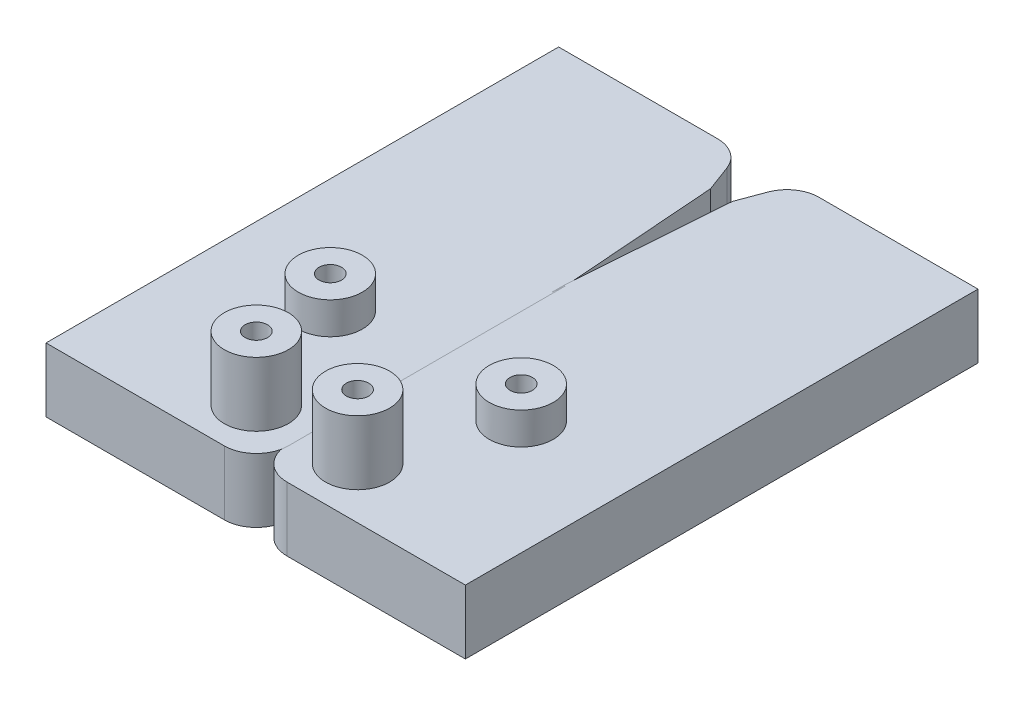
ISO-10303-21;
HEADER;
FILE_DESCRIPTION(('STEP AP214'),'2;1');
FILE_NAME('part.step','',(''),(''),'','','');
FILE_SCHEMA(('AUTOMOTIVE_DESIGN { 1 0 10303 214 1 1 1 1 }'));
ENDSEC;
DATA;
#1=APPLICATION_CONTEXT('core data for automotive mechanical design processes');
#2=APPLICATION_PROTOCOL_DEFINITION('international standard','automotive_design',2000,#1);
#3=PRODUCT_CONTEXT('',#1,'mechanical');
#4=PRODUCT('Part','Part','',(#3));
#5=PRODUCT_RELATED_PRODUCT_CATEGORY('part','',(#4));
#6=PRODUCT_DEFINITION_FORMATION('','',#4);
#7=PRODUCT_DEFINITION_CONTEXT('part definition',#1,'design');
#8=PRODUCT_DEFINITION('design','',#6,#7);
#9=PRODUCT_DEFINITION_SHAPE('','',#8);
#10=(LENGTH_UNIT() NAMED_UNIT(*) SI_UNIT(.MILLI.,.METRE.));
#11=(NAMED_UNIT(*) PLANE_ANGLE_UNIT() SI_UNIT($,.RADIAN.));
#12=(NAMED_UNIT(*) SI_UNIT($,.STERADIAN.) SOLID_ANGLE_UNIT());
#13=UNCERTAINTY_MEASURE_WITH_UNIT(LENGTH_MEASURE(1.E-05),#10,'distance_accuracy_value','');
#14=(GEOMETRIC_REPRESENTATION_CONTEXT(3) GLOBAL_UNCERTAINTY_ASSIGNED_CONTEXT((#13)) GLOBAL_UNIT_ASSIGNED_CONTEXT((#10,
#11,#12)) REPRESENTATION_CONTEXT('',''));
#15=CARTESIAN_POINT('',(0.,0.,0.));
#16=DIRECTION('',(0.,0.,1.));
#17=DIRECTION('',(1.,0.,0.));
#18=AXIS2_PLACEMENT_3D('',#15,#16,#17);
#19=CARTESIAN_POINT('',(7.90758980409123,10.,-22.6174511467878));
#20=DIRECTION('',(0.,-1.,0.));
#21=DIRECTION('',(0.,0.,-1.));
#22=AXIS2_PLACEMENT_3D('',#19,#20,#21);
#23=PLANE('',#22);
#24=CARTESIAN_POINT('',(7.9,10.,44.3825488532122));
#25=DIRECTION('',(0.,1.,0.));
#26=DIRECTION('',(0.,0.,-1.));
#27=AXIS2_PLACEMENT_3D('',#24,#25,#26);
#28=CIRCLE('',#27,5.);
#29=CARTESIAN_POINT('',(7.9,10.,39.3825488532122));
#30=VERTEX_POINT('',#29);
#31=EDGE_CURVE('E52',#30,#30,#28,.F.);
#32=ORIENTED_EDGE('',*,*,#31,.T.);
#33=EDGE_LOOP('',(#32));
#34=FACE_BOUND('',#33,.T.);
#35=DIRECTION('',(0.,0.,1.));
#36=VECTOR('',#35,1.);
#37=CARTESIAN_POINT('',(32.7241563055062,10.,52.3825488532122));
#38=LINE('',#37,#36);
#39=CARTESIAN_POINT('',(32.7241563055062,10.,-27.6174511467878));
#40=VERTEX_POINT('',#39);
#41=CARTESIAN_POINT('',(32.7241563055062,10.,52.3825488532122));
#42=VERTEX_POINT('',#41);
#43=EDGE_CURVE('E164',#40,#42,#38,.T.);
#44=ORIENTED_EDGE('',*,*,#43,.F.);
#45=DIRECTION('',(1.,0.,0.));
#46=VECTOR('',#45,1.);
#47=CARTESIAN_POINT('',(32.7241563055062,10.,-27.6174511467878));
#48=LINE('',#47,#46);
#49=CARTESIAN_POINT('',(7.90758980409123,10.,-27.6174511467878));
#50=VERTEX_POINT('',#49);
#51=EDGE_CURVE('E140',#50,#40,#48,.T.);
#52=ORIENTED_EDGE('',*,*,#51,.F.);
#53=CARTESIAN_POINT('',(7.90758980409123,10.,-22.6174511467878));
#54=DIRECTION('',(0.,-1.,0.));
#55=DIRECTION('',(0.,0.,-1.));
#56=AXIS2_PLACEMENT_3D('',#53,#54,#55);
#57=CIRCLE('',#56,5.);
#58=CARTESIAN_POINT('',(3.22211146882708,10.,-24.3628143667997));
#59=VERTEX_POINT('',#58);
#60=EDGE_CURVE('E121',#59,#50,#57,.T.);
#61=ORIENTED_EDGE('',*,*,#60,.F.);
#62=DIRECTION('',(0.349072644002376,0.,-0.937095667052831));
#63=VECTOR('',#62,1.);
#64=CARTESIAN_POINT('',(3.22211146882708,10.,-24.3628143667997));
#65=LINE('',#64,#63);
#66=CARTESIAN_POINT('',(1.71392265535283,10.,-20.314037625089));
#67=VERTEX_POINT('',#66);
#68=EDGE_CURVE('E130',#67,#59,#65,.T.);
#69=ORIENTED_EDGE('',*,*,#68,.F.);
#70=DIRECTION('',(0.0742461467148816,0.,-0.997239945899678));
#71=VECTOR('',#70,1.);
#72=CARTESIAN_POINT('',(1.71392265535283,10.,-20.314037625089));
#73=LINE('',#72,#71);
#74=CARTESIAN_POINT('',(-0.100000000000001,10.,4.04973357015986));
#75=VERTEX_POINT('',#74);
#76=EDGE_CURVE('E136',#75,#67,#73,.T.);
#77=ORIENTED_EDGE('',*,*,#76,.F.);
#78=DIRECTION('',(0.,0.,-1.));
#79=VECTOR('',#78,1.);
#80=CARTESIAN_POINT('',(-0.100000000000001,10.,4.04973357015986));
#81=LINE('',#80,#79);
#82=CARTESIAN_POINT('',(-0.1,10.,47.3825488532122));
#83=VERTEX_POINT('',#82);
#84=EDGE_CURVE('E233',#83,#75,#81,.T.);
#85=ORIENTED_EDGE('',*,*,#84,.F.);
#86=CARTESIAN_POINT('',(4.9,10.,47.3825488532122));
#87=DIRECTION('',(0.,-1.,0.));
#88=DIRECTION('',(0.,0.,-1.));
#89=AXIS2_PLACEMENT_3D('',#86,#87,#88);
#90=CIRCLE('',#89,5.);
#91=CARTESIAN_POINT('',(4.9,10.,52.3825488532122));
#92=VERTEX_POINT('',#91);
#93=EDGE_CURVE('E226',#92,#83,#90,.T.);
#94=ORIENTED_EDGE('',*,*,#93,.F.);
#95=DIRECTION('',(-1.,0.,0.));
#96=VECTOR('',#95,1.);
#97=CARTESIAN_POINT('',(4.9,10.,52.3825488532122));
#98=LINE('',#97,#96);
#99=EDGE_CURVE('E224',#42,#92,#98,.T.);
#100=ORIENTED_EDGE('',*,*,#99,.F.);
#101=EDGE_LOOP('',(#44,#52,#61,#69,#77,#85,#94,#100));
#102=FACE_BOUND('',#101,.T.);
#103=CARTESIAN_POINT('',(14.9,10.,25.8407363720252));
#104=DIRECTION('',(0.,1.,0.));
#105=DIRECTION('',(0.,0.,-1.));
#106=AXIS2_PLACEMENT_3D('',#103,#104,#105);
#107=CIRCLE('',#106,5.);
#108=CARTESIAN_POINT('',(14.9,10.,20.8407363720252));
#109=VERTEX_POINT('',#108);
#110=EDGE_CURVE('E12',#109,#109,#107,.F.);
#111=ORIENTED_EDGE('',*,*,#110,.T.);
#112=EDGE_LOOP('',(#111));
#113=FACE_BOUND('',#112,.T.);
#114=ADVANCED_FACE('F43',(#34,#102,#113),#23,.F.);
#115=CARTESIAN_POINT('',(32.7241563055062,10.,52.3825488532122));
#116=DIRECTION('',(-1.,0.,0.));
#117=DIRECTION('',(0.,0.,-1.));
#118=AXIS2_PLACEMENT_3D('',#115,#116,#117);
#119=PLANE('',#118);
#120=DIRECTION('',(0.,0.,1.));
#121=VECTOR('',#120,1.);
#122=CARTESIAN_POINT('',(32.7241563055062,0.,52.3825488532122));
#123=LINE('',#122,#121);
#124=CARTESIAN_POINT('',(32.7241563055062,0.,-27.6174511467878));
#125=VERTEX_POINT('',#124);
#126=CARTESIAN_POINT('',(32.7241563055062,0.,52.3825488532122));
#127=VERTEX_POINT('',#126);
#128=EDGE_CURVE('E145',#125,#127,#123,.T.);
#129=ORIENTED_EDGE('',*,*,#128,.F.);
#130=DIRECTION('',(0.,-1.,0.));
#131=VECTOR('',#130,1.);
#132=CARTESIAN_POINT('',(32.7241563055062,10.,-27.6174511467878));
#133=LINE('',#132,#131);
#134=EDGE_CURVE('E60',#40,#125,#133,.T.);
#135=ORIENTED_EDGE('',*,*,#134,.F.);
#136=ORIENTED_EDGE('',*,*,#43,.T.);
#137=DIRECTION('',(0.,-1.,0.));
#138=VECTOR('',#137,1.);
#139=CARTESIAN_POINT('',(32.7241563055062,10.,52.3825488532122));
#140=LINE('',#139,#138);
#141=EDGE_CURVE('E100',#42,#127,#140,.T.);
#142=ORIENTED_EDGE('',*,*,#141,.T.);
#143=EDGE_LOOP('',(#129,#135,#136,#142));
#144=FACE_BOUND('',#143,.T.);
#145=ADVANCED_FACE('F45',(#144),#119,.F.);
#146=CARTESIAN_POINT('',(4.9,10.,52.3825488532122));
#147=DIRECTION('',(0.,0.,-1.));
#148=DIRECTION('',(1.,0.,0.));
#149=AXIS2_PLACEMENT_3D('',#146,#147,#148);
#150=PLANE('',#149);
#151=DIRECTION('',(-1.,0.,0.));
#152=VECTOR('',#151,1.);
#153=CARTESIAN_POINT('',(4.9,0.,52.3825488532122));
#154=LINE('',#153,#152);
#155=CARTESIAN_POINT('',(4.9,0.,52.3825488532122));
#156=VERTEX_POINT('',#155);
#157=EDGE_CURVE('E147',#127,#156,#154,.T.);
#158=ORIENTED_EDGE('',*,*,#157,.F.);
#159=ORIENTED_EDGE('',*,*,#141,.F.);
#160=ORIENTED_EDGE('',*,*,#99,.T.);
#161=DIRECTION('',(0.,-1.,0.));
#162=VECTOR('',#161,1.);
#163=CARTESIAN_POINT('',(4.9,10.,52.3825488532122));
#164=LINE('',#163,#162);
#165=EDGE_CURVE('E174',#92,#156,#164,.T.);
#166=ORIENTED_EDGE('',*,*,#165,.T.);
#167=EDGE_LOOP('',(#158,#159,#160,#166));
#168=FACE_BOUND('',#167,.T.);
#169=ADVANCED_FACE('F202',(#168),#150,.F.);
#170=CARTESIAN_POINT('',(4.9,10.,47.3825488532122));
#171=DIRECTION('',(0.,-1.,0.));
#172=DIRECTION('',(0.,0.,-1.));
#173=AXIS2_PLACEMENT_3D('',#170,#171,#172);
#174=CYLINDRICAL_SURFACE('',#173,5.);
#175=CARTESIAN_POINT('',(4.9,0.,47.3825488532122));
#176=DIRECTION('',(0.,-1.,0.));
#177=DIRECTION('',(0.,0.,-1.));
#178=AXIS2_PLACEMENT_3D('',#175,#176,#177);
#179=CIRCLE('',#178,5.);
#180=CARTESIAN_POINT('',(-0.1,0.,47.3825488532122));
#181=VERTEX_POINT('',#180);
#182=EDGE_CURVE('E151',#156,#181,#179,.T.);
#183=ORIENTED_EDGE('',*,*,#182,.F.);
#184=ORIENTED_EDGE('',*,*,#165,.F.);
#185=ORIENTED_EDGE('',*,*,#93,.T.);
#186=DIRECTION('',(0.,-1.,0.));
#187=VECTOR('',#186,1.);
#188=CARTESIAN_POINT('',(-0.1,10.,47.3825488532122));
#189=LINE('',#188,#187);
#190=EDGE_CURVE('E171',#83,#181,#189,.T.);
#191=ORIENTED_EDGE('',*,*,#190,.T.);
#192=EDGE_LOOP('',(#183,#184,#185,#191));
#193=FACE_BOUND('',#192,.T.);
#194=ADVANCED_FACE('F217',(#193),#174,.T.);
#195=CARTESIAN_POINT('',(-0.100000000000001,10.,4.04973357015986));
#196=DIRECTION('',(1.,0.,0.));
#197=DIRECTION('',(0.,0.,1.));
#198=AXIS2_PLACEMENT_3D('',#195,#196,#197);
#199=PLANE('',#198);
#200=DIRECTION('',(0.,0.,-1.));
#201=VECTOR('',#200,1.);
#202=CARTESIAN_POINT('',(-0.100000000000001,0.,4.04973357015986));
#203=LINE('',#202,#201);
#204=CARTESIAN_POINT('',(-0.100000000000001,0.,4.04973357015986));
#205=VERTEX_POINT('',#204);
#206=EDGE_CURVE('E154',#181,#205,#203,.T.);
#207=ORIENTED_EDGE('',*,*,#206,.F.);
#208=ORIENTED_EDGE('',*,*,#190,.F.);
#209=ORIENTED_EDGE('',*,*,#84,.T.);
#210=DIRECTION('',(0.,-1.,0.));
#211=VECTOR('',#210,1.);
#212=CARTESIAN_POINT('',(-0.100000000000001,10.,4.04973357015986));
#213=LINE('',#212,#211);
#214=EDGE_CURVE('E168',#75,#205,#213,.T.);
#215=ORIENTED_EDGE('',*,*,#214,.T.);
#216=EDGE_LOOP('',(#207,#208,#209,#215));
#217=FACE_BOUND('',#216,.T.);
#218=ADVANCED_FACE('F213',(#217),#199,.F.);
#219=CARTESIAN_POINT('',(1.71392265535283,10.,-20.314037625089));
#220=DIRECTION('',(0.997239945899678,0.,0.0742461467148816));
#221=DIRECTION('',(-0.0742461467148816,0.,0.997239945899678));
#222=AXIS2_PLACEMENT_3D('',#219,#220,#221);
#223=PLANE('',#222);
#224=DIRECTION('',(0.0742461467148816,0.,-0.997239945899678));
#225=VECTOR('',#224,1.);
#226=CARTESIAN_POINT('',(1.71392265535283,0.,-20.314037625089));
#227=LINE('',#226,#225);
#228=CARTESIAN_POINT('',(1.71392265535283,0.,-20.314037625089));
#229=VERTEX_POINT('',#228);
#230=EDGE_CURVE('E157',#205,#229,#227,.T.);
#231=ORIENTED_EDGE('',*,*,#230,.F.);
#232=ORIENTED_EDGE('',*,*,#214,.F.);
#233=ORIENTED_EDGE('',*,*,#76,.T.);
#234=DIRECTION('',(0.,-1.,0.));
#235=VECTOR('',#234,1.);
#236=CARTESIAN_POINT('',(1.71392265535283,10.,-20.314037625089));
#237=LINE('',#236,#235);
#238=EDGE_CURVE('E126',#67,#229,#237,.T.);
#239=ORIENTED_EDGE('',*,*,#238,.T.);
#240=EDGE_LOOP('',(#231,#232,#233,#239));
#241=FACE_BOUND('',#240,.T.);
#242=ADVANCED_FACE('F210',(#241),#223,.F.);
#243=CARTESIAN_POINT('',(3.22211146882708,10.,-24.3628143667997));
#244=DIRECTION('',(0.937095667052831,0.,0.349072644002376));
#245=DIRECTION('',(-0.349072644002376,0.,0.937095667052831));
#246=AXIS2_PLACEMENT_3D('',#243,#244,#245);
#247=PLANE('',#246);
#248=DIRECTION('',(0.349072644002376,0.,-0.937095667052831));
#249=VECTOR('',#248,1.);
#250=CARTESIAN_POINT('',(3.22211146882708,0.,-24.3628143667997));
#251=LINE('',#250,#249);
#252=CARTESIAN_POINT('',(3.22211146882708,0.,-24.3628143667997));
#253=VERTEX_POINT('',#252);
#254=EDGE_CURVE('E160',#229,#253,#251,.T.);
#255=ORIENTED_EDGE('',*,*,#254,.F.);
#256=ORIENTED_EDGE('',*,*,#238,.F.);
#257=ORIENTED_EDGE('',*,*,#68,.T.);
#258=DIRECTION('',(0.,-1.,0.));
#259=VECTOR('',#258,1.);
#260=CARTESIAN_POINT('',(3.22211146882708,10.,-24.3628143667997));
#261=LINE('',#260,#259);
#262=EDGE_CURVE('E117',#59,#253,#261,.T.);
#263=ORIENTED_EDGE('',*,*,#262,.T.);
#264=EDGE_LOOP('',(#255,#256,#257,#263));
#265=FACE_BOUND('',#264,.T.);
#266=ADVANCED_FACE('F131',(#265),#247,.F.);
#267=CARTESIAN_POINT('',(7.90758980409123,10.,-22.6174511467878));
#268=DIRECTION('',(0.,-1.,0.));
#269=DIRECTION('',(0.,0.,-1.));
#270=AXIS2_PLACEMENT_3D('',#267,#268,#269);
#271=CYLINDRICAL_SURFACE('',#270,5.);
#272=CARTESIAN_POINT('',(7.90758980409123,0.,-22.6174511467878));
#273=DIRECTION('',(0.,-1.,0.));
#274=DIRECTION('',(0.,0.,-1.));
#275=AXIS2_PLACEMENT_3D('',#272,#273,#274);
#276=CIRCLE('',#275,5.);
#277=CARTESIAN_POINT('',(7.90758980409123,0.,-27.6174511467878));
#278=VERTEX_POINT('',#277);
#279=EDGE_CURVE('E123',#253,#278,#276,.T.);
#280=ORIENTED_EDGE('',*,*,#279,.F.);
#281=ORIENTED_EDGE('',*,*,#262,.F.);
#282=ORIENTED_EDGE('',*,*,#60,.T.);
#283=DIRECTION('',(0.,-1.,0.));
#284=VECTOR('',#283,1.);
#285=CARTESIAN_POINT('',(7.90758980409123,10.,-27.6174511467878));
#286=LINE('',#285,#284);
#287=EDGE_CURVE('E127',#50,#278,#286,.T.);
#288=ORIENTED_EDGE('',*,*,#287,.T.);
#289=EDGE_LOOP('',(#280,#281,#282,#288));
#290=FACE_BOUND('',#289,.T.);
#291=ADVANCED_FACE('F119',(#290),#271,.T.);
#292=CARTESIAN_POINT('',(32.7241563055062,10.,-27.6174511467878));
#293=DIRECTION('',(0.,0.,1.));
#294=DIRECTION('',(-1.,0.,0.));
#295=AXIS2_PLACEMENT_3D('',#292,#293,#294);
#296=PLANE('',#295);
#297=DIRECTION('',(1.,0.,0.));
#298=VECTOR('',#297,1.);
#299=CARTESIAN_POINT('',(32.7241563055062,0.,-27.6174511467878));
#300=LINE('',#299,#298);
#301=EDGE_CURVE('E88',#278,#125,#300,.T.);
#302=ORIENTED_EDGE('',*,*,#301,.F.);
#303=ORIENTED_EDGE('',*,*,#287,.F.);
#304=ORIENTED_EDGE('',*,*,#51,.T.);
#305=ORIENTED_EDGE('',*,*,#134,.T.);
#306=EDGE_LOOP('',(#302,#303,#304,#305));
#307=FACE_BOUND('',#306,.T.);
#308=ADVANCED_FACE('F194',(#307),#296,.F.);
#309=CARTESIAN_POINT('',(7.90758980409123,0.,-22.6174511467878));
#310=DIRECTION('',(0.,-1.,0.));
#311=DIRECTION('',(0.,0.,-1.));
#312=AXIS2_PLACEMENT_3D('',#309,#310,#311);
#313=PLANE('',#312);
#314=ORIENTED_EDGE('',*,*,#128,.T.);
#315=ORIENTED_EDGE('',*,*,#157,.T.);
#316=ORIENTED_EDGE('',*,*,#182,.T.);
#317=ORIENTED_EDGE('',*,*,#206,.T.);
#318=ORIENTED_EDGE('',*,*,#230,.T.);
#319=ORIENTED_EDGE('',*,*,#254,.T.);
#320=ORIENTED_EDGE('',*,*,#279,.T.);
#321=ORIENTED_EDGE('',*,*,#301,.T.);
#322=EDGE_LOOP('',(#314,#315,#316,#317,#318,#319,#320,#321));
#323=FACE_BOUND('',#322,.T.);
#324=ADVANCED_FACE('F184',(#323),#313,.T.);
#325=CARTESIAN_POINT('',(7.9,20.,44.3825488532122));
#326=DIRECTION('',(0.,-1.,0.));
#327=DIRECTION('',(0.,0.,-1.));
#328=AXIS2_PLACEMENT_3D('',#325,#326,#327);
#329=CYLINDRICAL_SURFACE('',#328,5.);
#330=CARTESIAN_POINT('',(7.9,20.,44.3825488532122));
#331=DIRECTION('',(0.,-1.,0.));
#332=DIRECTION('',(0.,0.,1.));
#333=AXIS2_PLACEMENT_3D('',#330,#331,#332);
#334=CIRCLE('',#333,5.);
#335=CARTESIAN_POINT('',(7.9,20.,49.3825488532122));
#336=VERTEX_POINT('',#335);
#337=EDGE_CURVE('E148',#336,#336,#334,.T.);
#338=ORIENTED_EDGE('',*,*,#337,.T.);
#339=EDGE_LOOP('',(#338));
#340=FACE_BOUND('',#339,.T.);
#341=ORIENTED_EDGE('',*,*,#31,.F.);
#342=EDGE_LOOP('',(#341));
#343=FACE_BOUND('',#342,.T.);
#344=ADVANCED_FACE('F181',(#340,#343),#329,.T.);
#345=CARTESIAN_POINT('',(7.9,20.,44.3825488532122));
#346=DIRECTION('',(0.,1.,0.));
#347=DIRECTION('',(0.,0.,1.));
#348=AXIS2_PLACEMENT_3D('',#345,#346,#347);
#349=PLANE('',#348);
#350=CARTESIAN_POINT('',(7.9,20.,44.3825488532122));
#351=DIRECTION('',(0.,-1.,0.));
#352=DIRECTION('',(0.,0.,1.));
#353=AXIS2_PLACEMENT_3D('',#350,#351,#352);
#354=CIRCLE('',#353,1.75);
#355=CARTESIAN_POINT('',(7.9,20.,46.1325488532122));
#356=VERTEX_POINT('',#355);
#357=EDGE_CURVE('E241',#356,#356,#354,.T.);
#358=ORIENTED_EDGE('',*,*,#357,.T.);
#359=EDGE_LOOP('',(#358));
#360=FACE_BOUND('',#359,.T.);
#361=ORIENTED_EDGE('',*,*,#337,.F.);
#362=EDGE_LOOP('',(#361));
#363=FACE_BOUND('',#362,.T.);
#364=ADVANCED_FACE('F183',(#360,#363),#349,.T.);
#365=CARTESIAN_POINT('',(14.9,15.,25.8407363720252));
#366=DIRECTION('',(0.,-1.,0.));
#367=DIRECTION('',(0.,0.,-1.));
#368=AXIS2_PLACEMENT_3D('',#365,#366,#367);
#369=CYLINDRICAL_SURFACE('',#368,5.);
#370=CARTESIAN_POINT('',(14.9,15.,25.8407363720252));
#371=DIRECTION('',(0.,-1.,0.));
#372=DIRECTION('',(0.,0.,1.));
#373=AXIS2_PLACEMENT_3D('',#370,#371,#372);
#374=CIRCLE('',#373,5.);
#375=CARTESIAN_POINT('',(14.9,15.,30.8407363720252));
#376=VERTEX_POINT('',#375);
#377=EDGE_CURVE('E237',#376,#376,#374,.T.);
#378=ORIENTED_EDGE('',*,*,#377,.T.);
#379=EDGE_LOOP('',(#378));
#380=FACE_BOUND('',#379,.T.);
#381=ORIENTED_EDGE('',*,*,#110,.F.);
#382=EDGE_LOOP('',(#381));
#383=FACE_BOUND('',#382,.T.);
#384=ADVANCED_FACE('F191',(#380,#383),#369,.T.);
#385=CARTESIAN_POINT('',(14.9,15.,25.8407363720252));
#386=DIRECTION('',(0.,1.,0.));
#387=DIRECTION('',(0.,0.,1.));
#388=AXIS2_PLACEMENT_3D('',#385,#386,#387);
#389=PLANE('',#388);
#390=CARTESIAN_POINT('',(14.9,15.,25.8407363720252));
#391=DIRECTION('',(0.,-1.,0.));
#392=DIRECTION('',(0.,0.,1.));
#393=AXIS2_PLACEMENT_3D('',#390,#391,#392);
#394=CIRCLE('',#393,1.75);
#395=CARTESIAN_POINT('',(14.9,15.,27.5907363720252));
#396=VERTEX_POINT('',#395);
#397=EDGE_CURVE('E247',#396,#396,#394,.T.);
#398=ORIENTED_EDGE('',*,*,#397,.T.);
#399=EDGE_LOOP('',(#398));
#400=FACE_BOUND('',#399,.T.);
#401=ORIENTED_EDGE('',*,*,#377,.F.);
#402=EDGE_LOOP('',(#401));
#403=FACE_BOUND('',#402,.T.);
#404=ADVANCED_FACE('F271',(#400,#403),#389,.T.);
#405=CARTESIAN_POINT('',(7.9,10.,44.3825488532122));
#406=DIRECTION('',(0.,1.,0.));
#407=DIRECTION('',(0.,0.,1.));
#408=AXIS2_PLACEMENT_3D('',#405,#406,#407);
#409=CYLINDRICAL_SURFACE('',#408,1.75);
#410=CARTESIAN_POINT('',(7.9,10.,44.3825488532122));
#411=DIRECTION('',(0.,-1.,0.));
#412=DIRECTION('',(0.,0.,1.));
#413=AXIS2_PLACEMENT_3D('',#410,#411,#412);
#414=CIRCLE('',#413,1.75);
#415=CARTESIAN_POINT('',(7.9,10.,46.1325488532122));
#416=VERTEX_POINT('',#415);
#417=EDGE_CURVE('E240',#416,#416,#414,.T.);
#418=ORIENTED_EDGE('',*,*,#417,.T.);
#419=EDGE_LOOP('',(#418));
#420=FACE_BOUND('',#419,.T.);
#421=ORIENTED_EDGE('',*,*,#357,.F.);
#422=EDGE_LOOP('',(#421));
#423=FACE_BOUND('',#422,.T.);
#424=ADVANCED_FACE('F267',(#420,#423),#409,.F.);
#425=CARTESIAN_POINT('',(7.9,10.,44.3825488532122));
#426=DIRECTION('',(0.,1.,0.));
#427=DIRECTION('',(0.,0.,1.));
#428=AXIS2_PLACEMENT_3D('',#425,#426,#427);
#429=PLANE('',#428);
#430=ORIENTED_EDGE('',*,*,#417,.F.);
#431=EDGE_LOOP('',(#430));
#432=FACE_BOUND('',#431,.T.);
#433=ADVANCED_FACE('F262',(#432),#429,.T.);
#434=CARTESIAN_POINT('',(14.9,5.,25.8407363720252));
#435=DIRECTION('',(0.,1.,0.));
#436=DIRECTION('',(0.,0.,1.));
#437=AXIS2_PLACEMENT_3D('',#434,#435,#436);
#438=CYLINDRICAL_SURFACE('',#437,1.75);
#439=CARTESIAN_POINT('',(14.9,5.,25.8407363720252));
#440=DIRECTION('',(0.,-1.,0.));
#441=DIRECTION('',(0.,0.,1.));
#442=AXIS2_PLACEMENT_3D('',#439,#440,#441);
#443=CIRCLE('',#442,1.75);
#444=CARTESIAN_POINT('',(14.9,5.,27.5907363720252));
#445=VERTEX_POINT('',#444);
#446=EDGE_CURVE('E244',#445,#445,#443,.T.);
#447=ORIENTED_EDGE('',*,*,#446,.T.);
#448=EDGE_LOOP('',(#447));
#449=FACE_BOUND('',#448,.T.);
#450=ORIENTED_EDGE('',*,*,#397,.F.);
#451=EDGE_LOOP('',(#450));
#452=FACE_BOUND('',#451,.T.);
#453=ADVANCED_FACE('F253',(#449,#452),#438,.F.);
#454=CARTESIAN_POINT('',(14.9,5.,25.8407363720252));
#455=DIRECTION('',(0.,1.,0.));
#456=DIRECTION('',(0.,0.,1.));
#457=AXIS2_PLACEMENT_3D('',#454,#455,#456);
#458=PLANE('',#457);
#459=ORIENTED_EDGE('',*,*,#446,.F.);
#460=EDGE_LOOP('',(#459));
#461=FACE_BOUND('',#460,.T.);
#462=ADVANCED_FACE('F256',(#461),#458,.T.);
#463=CLOSED_SHELL('',(#114,#145,#169,#194,#218,#242,#266,#291,#308,#324,#344,#364,#384,#404,
#424,#433,#453,#462));
#464=MANIFOLD_SOLID_BREP('B2',#463);
#465=CARTESIAN_POINT('',(-7.90758980409123,10.,-22.6174511467878));
#466=DIRECTION('',(0.,-1.,0.));
#467=DIRECTION('',(0.,0.,-1.));
#468=AXIS2_PLACEMENT_3D('',#465,#466,#467);
#469=PLANE('',#468);
#470=CARTESIAN_POINT('',(-7.9,10.,44.3825488532122));
#471=DIRECTION('',(0.,-1.,0.));
#472=DIRECTION('',(0.,0.,-1.));
#473=AXIS2_PLACEMENT_3D('',#470,#471,#472);
#474=CIRCLE('',#473,5.);
#475=CARTESIAN_POINT('',(-7.9,10.,39.3825488532122));
#476=VERTEX_POINT('',#475);
#477=EDGE_CURVE('E400',#476,#476,#474,.F.);
#478=ORIENTED_EDGE('',*,*,#477,.F.);
#479=EDGE_LOOP('',(#478));
#480=FACE_BOUND('',#479,.T.);
#481=DIRECTION('',(0.,0.,1.));
#482=VECTOR('',#481,1.);
#483=CARTESIAN_POINT('',(-32.7241563055062,10.,52.3825488532122));
#484=LINE('',#483,#482);
#485=CARTESIAN_POINT('',(-32.7241563055062,10.,-27.6174511467878));
#486=VERTEX_POINT('',#485);
#487=CARTESIAN_POINT('',(-32.7241563055062,10.,52.3825488532122));
#488=VERTEX_POINT('',#487);
#489=EDGE_CURVE('E504',#486,#488,#484,.T.);
#490=ORIENTED_EDGE('',*,*,#489,.T.);
#491=DIRECTION('',(1.,0.,0.));
#492=VECTOR('',#491,1.);
#493=CARTESIAN_POINT('',(-4.9,10.,52.3825488532122));
#494=LINE('',#493,#492);
#495=CARTESIAN_POINT('',(-4.9,10.,52.3825488532122));
#496=VERTEX_POINT('',#495);
#497=EDGE_CURVE('E452',#488,#496,#494,.T.);
#498=ORIENTED_EDGE('',*,*,#497,.T.);
#499=CARTESIAN_POINT('',(-4.9,10.,47.3825488532122));
#500=DIRECTION('',(0.,1.,0.));
#501=DIRECTION('',(0.,0.,-1.));
#502=AXIS2_PLACEMENT_3D('',#499,#500,#501);
#503=CIRCLE('',#502,5.);
#504=CARTESIAN_POINT('',(0.1,10.,47.3825488532122));
#505=VERTEX_POINT('',#504);
#506=EDGE_CURVE('E563',#496,#505,#503,.T.);
#507=ORIENTED_EDGE('',*,*,#506,.T.);
#508=DIRECTION('',(0.,0.,-1.));
#509=VECTOR('',#508,1.);
#510=CARTESIAN_POINT('',(0.100000000000001,10.,4.04973357015986));
#511=LINE('',#510,#509);
#512=CARTESIAN_POINT('',(0.100000000000001,10.,4.04973357015986));
#513=VERTEX_POINT('',#512);
#514=EDGE_CURVE('E568',#505,#513,#511,.T.);
#515=ORIENTED_EDGE('',*,*,#514,.T.);
#516=DIRECTION('',(-0.0742461467148816,0.,-0.997239945899678));
#517=VECTOR('',#516,1.);
#518=CARTESIAN_POINT('',(-1.71392265535283,10.,-20.314037625089));
#519=LINE('',#518,#517);
#520=CARTESIAN_POINT('',(-1.71392265535283,10.,-20.314037625089));
#521=VERTEX_POINT('',#520);
#522=EDGE_CURVE('E471',#513,#521,#519,.T.);
#523=ORIENTED_EDGE('',*,*,#522,.T.);
#524=DIRECTION('',(-0.349072644002376,0.,-0.937095667052831));
#525=VECTOR('',#524,1.);
#526=CARTESIAN_POINT('',(-3.22211146882708,10.,-24.3628143667997));
#527=LINE('',#526,#525);
#528=CARTESIAN_POINT('',(-3.22211146882708,10.,-24.3628143667997));
#529=VERTEX_POINT('',#528);
#530=EDGE_CURVE('E465',#521,#529,#527,.T.);
#531=ORIENTED_EDGE('',*,*,#530,.T.);
#532=CARTESIAN_POINT('',(-7.90758980409123,10.,-22.6174511467878));
#533=DIRECTION('',(0.,1.,0.));
#534=DIRECTION('',(0.,0.,-1.));
#535=AXIS2_PLACEMENT_3D('',#532,#533,#534);
#536=CIRCLE('',#535,5.);
#537=CARTESIAN_POINT('',(-7.90758980409123,10.,-27.6174511467878));
#538=VERTEX_POINT('',#537);
#539=EDGE_CURVE('E469',#529,#538,#536,.T.);
#540=ORIENTED_EDGE('',*,*,#539,.T.);
#541=DIRECTION('',(-1.,0.,0.));
#542=VECTOR('',#541,1.);
#543=CARTESIAN_POINT('',(-32.7241563055062,10.,-27.6174511467878));
#544=LINE('',#543,#542);
#545=EDGE_CURVE('E408',#538,#486,#544,.T.);
#546=ORIENTED_EDGE('',*,*,#545,.T.);
#547=EDGE_LOOP('',(#490,#498,#507,#515,#523,#531,#540,#546));
#548=FACE_BOUND('',#547,.T.);
#549=CARTESIAN_POINT('',(-14.9,10.,25.8407363720252));
#550=DIRECTION('',(0.,-1.,0.));
#551=DIRECTION('',(0.,0.,-1.));
#552=AXIS2_PLACEMENT_3D('',#549,#550,#551);
#553=CIRCLE('',#552,5.);
#554=CARTESIAN_POINT('',(-14.9,10.,20.8407363720252));
#555=VERTEX_POINT('',#554);
#556=EDGE_CURVE('E41',#555,#555,#553,.F.);
#557=ORIENTED_EDGE('',*,*,#556,.F.);
#558=EDGE_LOOP('',(#557));
#559=FACE_BOUND('',#558,.T.);
#560=ADVANCED_FACE('F391',(#480,#548,#559),#469,.F.);
#561=CARTESIAN_POINT('',(-32.7241563055062,10.,52.3825488532122));
#562=DIRECTION('',(1.,0.,0.));
#563=DIRECTION('',(0.,0.,-1.));
#564=AXIS2_PLACEMENT_3D('',#561,#562,#563);
#565=PLANE('',#564);
#566=DIRECTION('',(0.,0.,1.));
#567=VECTOR('',#566,1.);
#568=CARTESIAN_POINT('',(-32.7241563055062,0.,52.3825488532122));
#569=LINE('',#568,#567);
#570=CARTESIAN_POINT('',(-32.7241563055062,0.,-27.6174511467878));
#571=VERTEX_POINT('',#570);
#572=CARTESIAN_POINT('',(-32.7241563055062,0.,52.3825488532122));
#573=VERTEX_POINT('',#572);
#574=EDGE_CURVE('E489',#571,#573,#569,.T.);
#575=ORIENTED_EDGE('',*,*,#574,.T.);
#576=DIRECTION('',(0.,-1.,0.));
#577=VECTOR('',#576,1.);
#578=CARTESIAN_POINT('',(-32.7241563055062,10.,52.3825488532122));
#579=LINE('',#578,#577);
#580=EDGE_CURVE('E517',#488,#573,#579,.T.);
#581=ORIENTED_EDGE('',*,*,#580,.F.);
#582=ORIENTED_EDGE('',*,*,#489,.F.);
#583=DIRECTION('',(0.,-1.,0.));
#584=VECTOR('',#583,1.);
#585=CARTESIAN_POINT('',(-32.7241563055062,10.,-27.6174511467878));
#586=LINE('',#585,#584);
#587=EDGE_CURVE('E485',#486,#571,#586,.T.);
#588=ORIENTED_EDGE('',*,*,#587,.T.);
#589=EDGE_LOOP('',(#575,#581,#582,#588));
#590=FACE_BOUND('',#589,.T.);
#591=ADVANCED_FACE('F393',(#590),#565,.F.);
#592=CARTESIAN_POINT('',(-4.9,10.,52.3825488532122));
#593=DIRECTION('',(0.,0.,-1.));
#594=DIRECTION('',(-1.,0.,0.));
#595=AXIS2_PLACEMENT_3D('',#592,#593,#594);
#596=PLANE('',#595);
#597=DIRECTION('',(1.,0.,0.));
#598=VECTOR('',#597,1.);
#599=CARTESIAN_POINT('',(-4.9,0.,52.3825488532122));
#600=LINE('',#599,#598);
#601=CARTESIAN_POINT('',(-4.9,0.,52.3825488532122));
#602=VERTEX_POINT('',#601);
#603=EDGE_CURVE('E492',#573,#602,#600,.T.);
#604=ORIENTED_EDGE('',*,*,#603,.T.);
#605=DIRECTION('',(0.,-1.,0.));
#606=VECTOR('',#605,1.);
#607=CARTESIAN_POINT('',(-4.9,10.,52.3825488532122));
#608=LINE('',#607,#606);
#609=EDGE_CURVE('E514',#496,#602,#608,.T.);
#610=ORIENTED_EDGE('',*,*,#609,.F.);
#611=ORIENTED_EDGE('',*,*,#497,.F.);
#612=ORIENTED_EDGE('',*,*,#580,.T.);
#613=EDGE_LOOP('',(#604,#610,#611,#612));
#614=FACE_BOUND('',#613,.T.);
#615=ADVANCED_FACE('F528',(#614),#596,.F.);
#616=CARTESIAN_POINT('',(-4.9,10.,47.3825488532122));
#617=DIRECTION('',(0.,-1.,0.));
#618=DIRECTION('',(0.,0.,-1.));
#619=AXIS2_PLACEMENT_3D('',#616,#617,#618);
#620=CYLINDRICAL_SURFACE('',#619,5.);
#621=CARTESIAN_POINT('',(-4.9,0.,47.3825488532122));
#622=DIRECTION('',(0.,1.,0.));
#623=DIRECTION('',(0.,0.,-1.));
#624=AXIS2_PLACEMENT_3D('',#621,#622,#623);
#625=CIRCLE('',#624,5.);
#626=CARTESIAN_POINT('',(0.1,0.,47.3825488532122));
#627=VERTEX_POINT('',#626);
#628=EDGE_CURVE('E495',#602,#627,#625,.T.);
#629=ORIENTED_EDGE('',*,*,#628,.T.);
#630=DIRECTION('',(0.,-1.,0.));
#631=VECTOR('',#630,1.);
#632=CARTESIAN_POINT('',(0.1,10.,47.3825488532122));
#633=LINE('',#632,#631);
#634=EDGE_CURVE('E511',#505,#627,#633,.T.);
#635=ORIENTED_EDGE('',*,*,#634,.F.);
#636=ORIENTED_EDGE('',*,*,#506,.F.);
#637=ORIENTED_EDGE('',*,*,#609,.T.);
#638=EDGE_LOOP('',(#629,#635,#636,#637));
#639=FACE_BOUND('',#638,.T.);
#640=ADVANCED_FACE('F551',(#639),#620,.T.);
#641=CARTESIAN_POINT('',(0.100000000000001,10.,4.04973357015986));
#642=DIRECTION('',(-1.,0.,0.));
#643=DIRECTION('',(0.,0.,1.));
#644=AXIS2_PLACEMENT_3D('',#641,#642,#643);
#645=PLANE('',#644);
#646=DIRECTION('',(0.,0.,-1.));
#647=VECTOR('',#646,1.);
#648=CARTESIAN_POINT('',(0.100000000000001,0.,4.04973357015986));
#649=LINE('',#648,#647);
#650=CARTESIAN_POINT('',(0.100000000000001,0.,4.04973357015986));
#651=VERTEX_POINT('',#650);
#652=EDGE_CURVE('E497',#627,#651,#649,.T.);
#653=ORIENTED_EDGE('',*,*,#652,.T.);
#654=DIRECTION('',(0.,-1.,0.));
#655=VECTOR('',#654,1.);
#656=CARTESIAN_POINT('',(0.100000000000001,10.,4.04973357015986));
#657=LINE('',#656,#655);
#658=EDGE_CURVE('E508',#513,#651,#657,.T.);
#659=ORIENTED_EDGE('',*,*,#658,.F.);
#660=ORIENTED_EDGE('',*,*,#514,.F.);
#661=ORIENTED_EDGE('',*,*,#634,.T.);
#662=EDGE_LOOP('',(#653,#659,#660,#661));
#663=FACE_BOUND('',#662,.T.);
#664=ADVANCED_FACE('F547',(#663),#645,.F.);
#665=CARTESIAN_POINT('',(-1.71392265535283,10.,-20.314037625089));
#666=DIRECTION('',(-0.997239945899678,0.,0.0742461467148816));
#667=DIRECTION('',(0.0742461467148816,0.,0.997239945899678));
#668=AXIS2_PLACEMENT_3D('',#665,#666,#667);
#669=PLANE('',#668);
#670=DIRECTION('',(-0.0742461467148816,0.,-0.997239945899678));
#671=VECTOR('',#670,1.);
#672=CARTESIAN_POINT('',(-1.71392265535283,0.,-20.314037625089));
#673=LINE('',#672,#671);
#674=CARTESIAN_POINT('',(-1.71392265535283,0.,-20.314037625089));
#675=VERTEX_POINT('',#674);
#676=EDGE_CURVE('E499',#651,#675,#673,.T.);
#677=ORIENTED_EDGE('',*,*,#676,.T.);
#678=DIRECTION('',(0.,-1.,0.));
#679=VECTOR('',#678,1.);
#680=CARTESIAN_POINT('',(-1.71392265535283,10.,-20.314037625089));
#681=LINE('',#680,#679);
#682=EDGE_CURVE('E480',#521,#675,#681,.T.);
#683=ORIENTED_EDGE('',*,*,#682,.F.);
#684=ORIENTED_EDGE('',*,*,#522,.F.);
#685=ORIENTED_EDGE('',*,*,#658,.T.);
#686=EDGE_LOOP('',(#677,#683,#684,#685));
#687=FACE_BOUND('',#686,.T.);
#688=ADVANCED_FACE('F544',(#687),#669,.F.);
#689=CARTESIAN_POINT('',(-3.22211146882708,10.,-24.3628143667997));
#690=DIRECTION('',(-0.937095667052831,0.,0.349072644002376));
#691=DIRECTION('',(0.349072644002376,0.,0.937095667052831));
#692=AXIS2_PLACEMENT_3D('',#689,#690,#691);
#693=PLANE('',#692);
#694=DIRECTION('',(-0.349072644002376,0.,-0.937095667052831));
#695=VECTOR('',#694,1.);
#696=CARTESIAN_POINT('',(-3.22211146882708,0.,-24.3628143667997));
#697=LINE('',#696,#695);
#698=CARTESIAN_POINT('',(-3.22211146882708,0.,-24.3628143667997));
#699=VERTEX_POINT('',#698);
#700=EDGE_CURVE('E479',#675,#699,#697,.T.);
#701=ORIENTED_EDGE('',*,*,#700,.T.);
#702=DIRECTION('',(0.,-1.,0.));
#703=VECTOR('',#702,1.);
#704=CARTESIAN_POINT('',(-3.22211146882708,10.,-24.3628143667997));
#705=LINE('',#704,#703);
#706=EDGE_CURVE('E476',#529,#699,#705,.T.);
#707=ORIENTED_EDGE('',*,*,#706,.F.);
#708=ORIENTED_EDGE('',*,*,#530,.F.);
#709=ORIENTED_EDGE('',*,*,#682,.T.);
#710=EDGE_LOOP('',(#701,#707,#708,#709));
#711=FACE_BOUND('',#710,.T.);
#712=ADVANCED_FACE('F477',(#711),#693,.F.);
#713=CARTESIAN_POINT('',(-7.90758980409123,10.,-22.6174511467878));
#714=DIRECTION('',(0.,-1.,0.));
#715=DIRECTION('',(0.,0.,-1.));
#716=AXIS2_PLACEMENT_3D('',#713,#714,#715);
#717=CYLINDRICAL_SURFACE('',#716,5.);
#718=CARTESIAN_POINT('',(-7.90758980409123,0.,-22.6174511467878));
#719=DIRECTION('',(0.,1.,0.));
#720=DIRECTION('',(0.,0.,-1.));
#721=AXIS2_PLACEMENT_3D('',#718,#719,#720);
#722=CIRCLE('',#721,5.);
#723=CARTESIAN_POINT('',(-7.90758980409123,0.,-27.6174511467878));
#724=VERTEX_POINT('',#723);
#725=EDGE_CURVE('E437',#699,#724,#722,.T.);
#726=ORIENTED_EDGE('',*,*,#725,.T.);
#727=DIRECTION('',(0.,-1.,0.));
#728=VECTOR('',#727,1.);
#729=CARTESIAN_POINT('',(-7.90758980409123,10.,-27.6174511467878));
#730=LINE('',#729,#728);
#731=EDGE_CURVE('E481',#538,#724,#730,.T.);
#732=ORIENTED_EDGE('',*,*,#731,.F.);
#733=ORIENTED_EDGE('',*,*,#539,.F.);
#734=ORIENTED_EDGE('',*,*,#706,.T.);
#735=EDGE_LOOP('',(#726,#732,#733,#734));
#736=FACE_BOUND('',#735,.T.);
#737=ADVANCED_FACE('F483',(#736),#717,.T.);
#738=CARTESIAN_POINT('',(-32.7241563055062,10.,-27.6174511467878));
#739=DIRECTION('',(0.,0.,1.));
#740=DIRECTION('',(1.,0.,0.));
#741=AXIS2_PLACEMENT_3D('',#738,#739,#740);
#742=PLANE('',#741);
#743=DIRECTION('',(-1.,0.,0.));
#744=VECTOR('',#743,1.);
#745=CARTESIAN_POINT('',(-32.7241563055062,0.,-27.6174511467878));
#746=LINE('',#745,#744);
#747=EDGE_CURVE('E443',#724,#571,#746,.T.);
#748=ORIENTED_EDGE('',*,*,#747,.T.);
#749=ORIENTED_EDGE('',*,*,#587,.F.);
#750=ORIENTED_EDGE('',*,*,#545,.F.);
#751=ORIENTED_EDGE('',*,*,#731,.T.);
#752=EDGE_LOOP('',(#748,#749,#750,#751));
#753=FACE_BOUND('',#752,.T.);
#754=ADVANCED_FACE('F536',(#753),#742,.F.);
#755=CARTESIAN_POINT('',(-7.90758980409123,0.,-22.6174511467878));
#756=DIRECTION('',(0.,-1.,0.));
#757=DIRECTION('',(0.,0.,-1.));
#758=AXIS2_PLACEMENT_3D('',#755,#756,#757);
#759=PLANE('',#758);
#760=ORIENTED_EDGE('',*,*,#574,.F.);
#761=ORIENTED_EDGE('',*,*,#747,.F.);
#762=ORIENTED_EDGE('',*,*,#725,.F.);
#763=ORIENTED_EDGE('',*,*,#700,.F.);
#764=ORIENTED_EDGE('',*,*,#676,.F.);
#765=ORIENTED_EDGE('',*,*,#652,.F.);
#766=ORIENTED_EDGE('',*,*,#628,.F.);
#767=ORIENTED_EDGE('',*,*,#603,.F.);
#768=EDGE_LOOP('',(#760,#761,#762,#763,#764,#765,#766,#767));
#769=FACE_BOUND('',#768,.T.);
#770=ADVANCED_FACE('F533',(#769),#759,.T.);
#771=CARTESIAN_POINT('',(-7.9,20.,44.3825488532122));
#772=DIRECTION('',(0.,-1.,0.));
#773=DIRECTION('',(0.,0.,-1.));
#774=AXIS2_PLACEMENT_3D('',#771,#772,#773);
#775=CYLINDRICAL_SURFACE('',#774,5.);
#776=CARTESIAN_POINT('',(-7.9,20.,44.3825488532122));
#777=DIRECTION('',(0.,1.,0.));
#778=DIRECTION('',(0.,0.,1.));
#779=AXIS2_PLACEMENT_3D('',#776,#777,#778);
#780=CIRCLE('',#779,5.);
#781=CARTESIAN_POINT('',(-7.9,20.,49.3825488532122));
#782=VERTEX_POINT('',#781);
#783=EDGE_CURVE('E493',#782,#782,#780,.T.);
#784=ORIENTED_EDGE('',*,*,#783,.F.);
#785=EDGE_LOOP('',(#784));
#786=FACE_BOUND('',#785,.T.);
#787=ORIENTED_EDGE('',*,*,#477,.T.);
#788=EDGE_LOOP('',(#787));
#789=FACE_BOUND('',#788,.T.);
#790=ADVANCED_FACE('F521',(#786,#789),#775,.T.);
#791=CARTESIAN_POINT('',(-7.9,20.,44.3825488532122));
#792=DIRECTION('',(0.,1.,0.));
#793=DIRECTION('',(0.,0.,1.));
#794=AXIS2_PLACEMENT_3D('',#791,#792,#793);
#795=PLANE('',#794);
#796=CARTESIAN_POINT('',(-7.9,20.,44.3825488532122));
#797=DIRECTION('',(0.,1.,0.));
#798=DIRECTION('',(0.,0.,1.));
#799=AXIS2_PLACEMENT_3D('',#796,#797,#798);
#800=CIRCLE('',#799,1.75);
#801=CARTESIAN_POINT('',(-7.9,20.,46.1325488532122));
#802=VERTEX_POINT('',#801);
#803=EDGE_CURVE('E580',#802,#802,#800,.T.);
#804=ORIENTED_EDGE('',*,*,#803,.F.);
#805=EDGE_LOOP('',(#804));
#806=FACE_BOUND('',#805,.T.);
#807=ORIENTED_EDGE('',*,*,#783,.T.);
#808=EDGE_LOOP('',(#807));
#809=FACE_BOUND('',#808,.T.);
#810=ADVANCED_FACE('F611',(#806,#809),#795,.T.);
#811=CARTESIAN_POINT('',(-14.9,15.,25.8407363720252));
#812=DIRECTION('',(0.,-1.,0.));
#813=DIRECTION('',(0.,0.,-1.));
#814=AXIS2_PLACEMENT_3D('',#811,#812,#813);
#815=CYLINDRICAL_SURFACE('',#814,5.);
#816=CARTESIAN_POINT('',(-14.9,15.,25.8407363720252));
#817=DIRECTION('',(0.,1.,0.));
#818=DIRECTION('',(0.,0.,1.));
#819=AXIS2_PLACEMENT_3D('',#816,#817,#818);
#820=CIRCLE('',#819,5.);
#821=CARTESIAN_POINT('',(-14.9,15.,30.8407363720252));
#822=VERTEX_POINT('',#821);
#823=EDGE_CURVE('E576',#822,#822,#820,.T.);
#824=ORIENTED_EDGE('',*,*,#823,.F.);
#825=EDGE_LOOP('',(#824));
#826=FACE_BOUND('',#825,.T.);
#827=ORIENTED_EDGE('',*,*,#556,.T.);
#828=EDGE_LOOP('',(#827));
#829=FACE_BOUND('',#828,.T.);
#830=ADVANCED_FACE('F605',(#826,#829),#815,.T.);
#831=CARTESIAN_POINT('',(-14.9,15.,25.8407363720252));
#832=DIRECTION('',(0.,1.,0.));
#833=DIRECTION('',(0.,0.,1.));
#834=AXIS2_PLACEMENT_3D('',#831,#832,#833);
#835=PLANE('',#834);
#836=CARTESIAN_POINT('',(-14.9,15.,25.8407363720252));
#837=DIRECTION('',(0.,1.,0.));
#838=DIRECTION('',(0.,0.,1.));
#839=AXIS2_PLACEMENT_3D('',#836,#837,#838);
#840=CIRCLE('',#839,1.75);
#841=CARTESIAN_POINT('',(-14.9,15.,27.5907363720252));
#842=VERTEX_POINT('',#841);
#843=EDGE_CURVE('E586',#842,#842,#840,.T.);
#844=ORIENTED_EDGE('',*,*,#843,.F.);
#845=EDGE_LOOP('',(#844));
#846=FACE_BOUND('',#845,.T.);
#847=ORIENTED_EDGE('',*,*,#823,.T.);
#848=EDGE_LOOP('',(#847));
#849=FACE_BOUND('',#848,.T.);
#850=ADVANCED_FACE('F601',(#846,#849),#835,.T.);
#851=CARTESIAN_POINT('',(-7.9,10.,44.3825488532122));
#852=DIRECTION('',(0.,1.,0.));
#853=DIRECTION('',(0.,0.,1.));
#854=AXIS2_PLACEMENT_3D('',#851,#852,#853);
#855=CYLINDRICAL_SURFACE('',#854,1.75);
#856=CARTESIAN_POINT('',(-7.9,10.,44.3825488532122));
#857=DIRECTION('',(0.,1.,0.));
#858=DIRECTION('',(0.,0.,1.));
#859=AXIS2_PLACEMENT_3D('',#856,#857,#858);
#860=CIRCLE('',#859,1.75);
#861=CARTESIAN_POINT('',(-7.9,10.,46.1325488532122));
#862=VERTEX_POINT('',#861);
#863=EDGE_CURVE('E579',#862,#862,#860,.T.);
#864=ORIENTED_EDGE('',*,*,#863,.F.);
#865=EDGE_LOOP('',(#864));
#866=FACE_BOUND('',#865,.T.);
#867=ORIENTED_EDGE('',*,*,#803,.T.);
#868=EDGE_LOOP('',(#867));
#869=FACE_BOUND('',#868,.T.);
#870=ADVANCED_FACE('F604',(#866,#869),#855,.F.);
#871=CARTESIAN_POINT('',(-7.9,10.,44.3825488532122));
#872=DIRECTION('',(0.,1.,0.));
#873=DIRECTION('',(0.,0.,1.));
#874=AXIS2_PLACEMENT_3D('',#871,#872,#873);
#875=PLANE('',#874);
#876=ORIENTED_EDGE('',*,*,#863,.T.);
#877=EDGE_LOOP('',(#876));
#878=FACE_BOUND('',#877,.T.);
#879=ADVANCED_FACE('F597',(#878),#875,.T.);
#880=CARTESIAN_POINT('',(-14.9,5.,25.8407363720252));
#881=DIRECTION('',(0.,1.,0.));
#882=DIRECTION('',(0.,0.,1.));
#883=AXIS2_PLACEMENT_3D('',#880,#881,#882);
#884=CYLINDRICAL_SURFACE('',#883,1.75);
#885=CARTESIAN_POINT('',(-14.9,5.,25.8407363720252));
#886=DIRECTION('',(0.,1.,0.));
#887=DIRECTION('',(0.,0.,1.));
#888=AXIS2_PLACEMENT_3D('',#885,#886,#887);
#889=CIRCLE('',#888,1.75);
#890=CARTESIAN_POINT('',(-14.9,5.,27.5907363720252));
#891=VERTEX_POINT('',#890);
#892=EDGE_CURVE('E583',#891,#891,#889,.T.);
#893=ORIENTED_EDGE('',*,*,#892,.F.);
#894=EDGE_LOOP('',(#893));
#895=FACE_BOUND('',#894,.T.);
#896=ORIENTED_EDGE('',*,*,#843,.T.);
#897=EDGE_LOOP('',(#896));
#898=FACE_BOUND('',#897,.T.);
#899=ADVANCED_FACE('F594',(#895,#898),#884,.F.);
#900=CARTESIAN_POINT('',(-14.9,5.,25.8407363720252));
#901=DIRECTION('',(0.,1.,0.));
#902=DIRECTION('',(0.,0.,1.));
#903=AXIS2_PLACEMENT_3D('',#900,#901,#902);
#904=PLANE('',#903);
#905=ORIENTED_EDGE('',*,*,#892,.T.);
#906=EDGE_LOOP('',(#905));
#907=FACE_BOUND('',#906,.T.);
#908=ADVANCED_FACE('F592',(#907),#904,.T.);
#909=CLOSED_SHELL('',(#560,#591,#615,#640,#664,#688,#712,#737,#754,#770,#790,#810,#830,#850,
#870,#879,#899,#908));
#910=MANIFOLD_SOLID_BREP('B6',#909);
#911=ADVANCED_BREP_SHAPE_REPRESENTATION('',(#18,#464,#910),#14);
#912=SHAPE_DEFINITION_REPRESENTATION(#9,#911);
ENDSEC;
END-ISO-10303-21;
